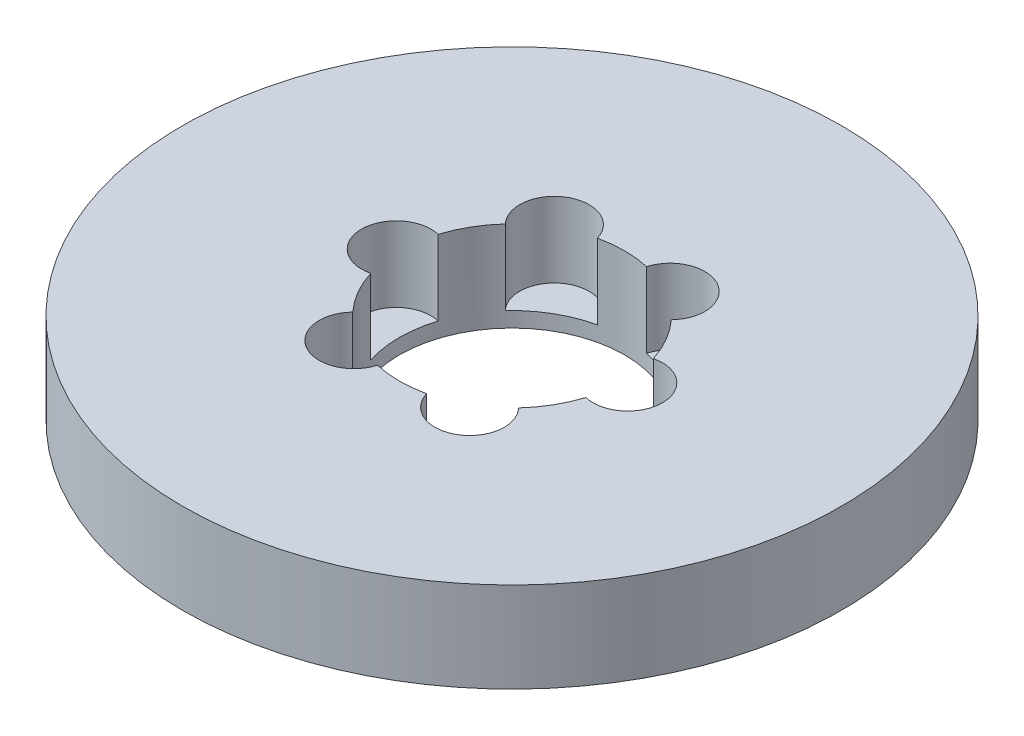
ISO-10303-21;
HEADER;
FILE_DESCRIPTION(('STEP AP214'),'2;1');
FILE_NAME('part.step','',(''),(''),'','','');
FILE_SCHEMA(('AUTOMOTIVE_DESIGN { 1 0 10303 214 1 1 1 1 }'));
ENDSEC;
DATA;
#1=APPLICATION_CONTEXT('core data for automotive mechanical design processes');
#2=APPLICATION_PROTOCOL_DEFINITION('international standard','automotive_design',2000,#1);
#3=PRODUCT_CONTEXT('',#1,'mechanical');
#4=PRODUCT('Part','Part','',(#3));
#5=PRODUCT_RELATED_PRODUCT_CATEGORY('part','',(#4));
#6=PRODUCT_DEFINITION_FORMATION('','',#4);
#7=PRODUCT_DEFINITION_CONTEXT('part definition',#1,'design');
#8=PRODUCT_DEFINITION('design','',#6,#7);
#9=PRODUCT_DEFINITION_SHAPE('','',#8);
#10=(LENGTH_UNIT() NAMED_UNIT(*) SI_UNIT(.MILLI.,.METRE.));
#11=(NAMED_UNIT(*) PLANE_ANGLE_UNIT() SI_UNIT($,.RADIAN.));
#12=(NAMED_UNIT(*) SI_UNIT($,.STERADIAN.) SOLID_ANGLE_UNIT());
#13=UNCERTAINTY_MEASURE_WITH_UNIT(LENGTH_MEASURE(1.E-05),#10,'distance_accuracy_value','');
#14=(GEOMETRIC_REPRESENTATION_CONTEXT(3) GLOBAL_UNCERTAINTY_ASSIGNED_CONTEXT((#13)) GLOBAL_UNIT_ASSIGNED_CONTEXT((#10,
#11,#12)) REPRESENTATION_CONTEXT('',''));
#15=CARTESIAN_POINT('',(0.,0.,0.));
#16=DIRECTION('',(0.,0.,1.));
#17=DIRECTION('',(1.,0.,0.));
#18=AXIS2_PLACEMENT_3D('',#15,#16,#17);
#19=CARTESIAN_POINT('',(0.,26.,0.));
#20=DIRECTION('',(0.,-1.,0.));
#21=DIRECTION('',(0.,0.,-1.));
#22=AXIS2_PLACEMENT_3D('',#19,#20,#21);
#23=CYLINDRICAL_SURFACE('',#22,95.);
#24=CARTESIAN_POINT('',(0.,26.,0.));
#25=DIRECTION('',(0.,1.,0.));
#26=DIRECTION('',(0.,0.,1.));
#27=AXIS2_PLACEMENT_3D('',#24,#25,#26);
#28=CIRCLE('',#27,95.);
#29=CARTESIAN_POINT('',(0.,26.,-95.));
#30=VERTEX_POINT('',#29);
#31=EDGE_CURVE('E171',#30,#30,#28,.T.);
#32=CARTESIAN_POINT('',(0.,0.,0.));
#33=DIRECTION('',(0.,1.,0.));
#34=DIRECTION('',(0.,0.,1.));
#35=AXIS2_PLACEMENT_3D('',#32,#33,#34);
#36=CIRCLE('',#35,95.);
#37=CARTESIAN_POINT('',(0.,0.,-95.));
#38=VERTEX_POINT('',#37);
#39=EDGE_CURVE('E157',#38,#38,#36,.T.);
#40=CARTESIAN_POINT('',(0.,26.,-95.));
#41=CARTESIAN_POINT('',(0.,25.7291666666667,-95.));
#42=CARTESIAN_POINT('',(0.,25.4583333333333,-95.));
#43=CARTESIAN_POINT('',(0.,24.9166666666667,-95.));
#44=CARTESIAN_POINT('',(0.,24.6458333333333,-95.));
#45=CARTESIAN_POINT('',(0.,24.1041666666667,-95.));
#46=CARTESIAN_POINT('',(0.,23.8333333333333,-95.));
#47=CARTESIAN_POINT('',(0.,23.2916666666667,-95.));
#48=CARTESIAN_POINT('',(0.,23.0208333333333,-95.));
#49=CARTESIAN_POINT('',(0.,22.4791666666667,-95.));
#50=CARTESIAN_POINT('',(0.,22.2083333333333,-95.));
#51=CARTESIAN_POINT('',(0.,21.6666666666667,-95.));
#52=CARTESIAN_POINT('',(0.,21.3958333333333,-95.));
#53=CARTESIAN_POINT('',(0.,20.8541666666667,-95.));
#54=CARTESIAN_POINT('',(0.,20.5833333333333,-95.));
#55=CARTESIAN_POINT('',(0.,20.0416666666667,-95.));
#56=CARTESIAN_POINT('',(0.,19.7708333333333,-95.));
#57=CARTESIAN_POINT('',(0.,19.2291666666667,-95.));
#58=CARTESIAN_POINT('',(0.,18.9583333333333,-95.));
#59=CARTESIAN_POINT('',(0.,18.4166666666667,-95.));
#60=CARTESIAN_POINT('',(0.,18.1458333333333,-95.));
#61=CARTESIAN_POINT('',(0.,17.6041666666667,-95.));
#62=CARTESIAN_POINT('',(0.,17.3333333333333,-95.));
#63=CARTESIAN_POINT('',(0.,16.7916666666667,-95.));
#64=CARTESIAN_POINT('',(0.,16.5208333333333,-95.));
#65=CARTESIAN_POINT('',(0.,15.9791666666667,-95.));
#66=CARTESIAN_POINT('',(0.,15.7083333333333,-95.));
#67=CARTESIAN_POINT('',(0.,15.1666666666667,-95.));
#68=CARTESIAN_POINT('',(0.,14.8958333333333,-95.));
#69=CARTESIAN_POINT('',(0.,14.3541666666667,-95.));
#70=CARTESIAN_POINT('',(0.,14.0833333333333,-95.));
#71=CARTESIAN_POINT('',(0.,13.5416666666667,-95.));
#72=CARTESIAN_POINT('',(0.,13.2708333333333,-95.));
#73=CARTESIAN_POINT('',(0.,12.7291666666667,-95.));
#74=CARTESIAN_POINT('',(0.,12.4583333333333,-95.));
#75=CARTESIAN_POINT('',(0.,11.9166666666667,-95.));
#76=CARTESIAN_POINT('',(0.,11.6458333333333,-95.));
#77=CARTESIAN_POINT('',(0.,11.1041666666667,-95.));
#78=CARTESIAN_POINT('',(0.,10.8333333333333,-95.));
#79=CARTESIAN_POINT('',(0.,10.2916666666667,-95.));
#80=CARTESIAN_POINT('',(0.,10.0208333333333,-95.));
#81=CARTESIAN_POINT('',(0.,9.47916666666667,-95.));
#82=CARTESIAN_POINT('',(0.,9.20833333333333,-95.));
#83=CARTESIAN_POINT('',(0.,8.66666666666667,-95.));
#84=CARTESIAN_POINT('',(0.,8.39583333333333,-95.));
#85=CARTESIAN_POINT('',(0.,7.85416666666667,-95.));
#86=CARTESIAN_POINT('',(0.,7.58333333333333,-95.));
#87=CARTESIAN_POINT('',(0.,7.04166666666667,-95.));
#88=CARTESIAN_POINT('',(0.,6.77083333333333,-95.));
#89=CARTESIAN_POINT('',(0.,6.22916666666667,-95.));
#90=CARTESIAN_POINT('',(0.,5.95833333333333,-95.));
#91=CARTESIAN_POINT('',(0.,5.41666666666667,-95.));
#92=CARTESIAN_POINT('',(0.,5.14583333333333,-95.));
#93=CARTESIAN_POINT('',(0.,4.60416666666667,-95.));
#94=CARTESIAN_POINT('',(0.,4.33333333333333,-95.));
#95=CARTESIAN_POINT('',(0.,3.79166666666667,-95.));
#96=CARTESIAN_POINT('',(0.,3.52083333333333,-95.));
#97=CARTESIAN_POINT('',(0.,2.97916666666667,-95.));
#98=CARTESIAN_POINT('',(0.,2.70833333333333,-95.));
#99=CARTESIAN_POINT('',(0.,2.16666666666667,-95.));
#100=CARTESIAN_POINT('',(0.,1.89583333333333,-95.));
#101=CARTESIAN_POINT('',(0.,1.35416666666667,-95.));
#102=CARTESIAN_POINT('',(0.,1.08333333333333,-95.));
#103=CARTESIAN_POINT('',(0.,0.541666666666667,-95.));
#104=CARTESIAN_POINT('',(0.,0.270833333333334,-95.));
#105=CARTESIAN_POINT('',(0.,0.,-95.));
#106=B_SPLINE_CURVE_WITH_KNOTS('',3,(#40,#41,#42,#43,#44,#45,#46,#47,#48,#49,#50,#51,#52,#53,
#54,#55,#56,#57,#58,#59,#60,#61,#62,#63,#64,#65,#66,#67,#68,#69,#70,#71,#72,#73,#74,#75,#76,#77,
#78,#79,#80,#81,#82,#83,#84,#85,#86,#87,#88,#89,#90,#91,#92,#93,#94,#95,#96,#97,#98,#99,#100,
#101,#102,#103,#104,#105),.UNSPECIFIED.,.F.,.F.,(4,2,2,2,2,2,2,2,2,2,2,2,2,2,2,2,2,2,2,2,2,2,2,
2,2,2,2,2,2,2,2,2,4),(0.,0.812500000000001,1.625,2.4375,3.25,4.0625,4.875,5.6875,6.5,7.3125,
8.125,8.9375,9.75,10.5625,11.375,12.1875,13.,13.8125,14.625,15.4375,16.25,17.0625,17.875,
18.6875,19.5,20.3125,21.125,21.9375,22.75,23.5625,24.375,25.1875,26.),.UNSPECIFIED.);
#107=EDGE_CURVE('BSEAM39',#30,#38,#106,.T.);
#108=ORIENTED_EDGE('',*,*,#31,.F.);
#109=ORIENTED_EDGE('',*,*,#39,.T.);
#110=ORIENTED_EDGE('',*,*,#107,.T.);
#111=ORIENTED_EDGE('',*,*,#107,.F.);
#112=EDGE_LOOP('',(#108,#110,#109,#111));
#113=FACE_BOUND('',#112,.T.);
#114=ADVANCED_FACE('F39',(#113),#23,.T.);
#115=CARTESIAN_POINT('',(0.,26.,0.));
#116=DIRECTION('',(0.,1.,0.));
#117=DIRECTION('',(0.,0.,1.));
#118=AXIS2_PLACEMENT_3D('',#115,#116,#117);
#119=PLANE('',#118);
#120=CARTESIAN_POINT('',(-16.6858090005491,26.,-28.9006689543404));
#121=DIRECTION('',(0.,1.,0.));
#122=DIRECTION('',(-0.866025403784433,0.,0.50000000000001));
#123=AXIS2_PLACEMENT_3D('',#120,#121,#122);
#124=CIRCLE('',#123,10.);
#125=CARTESIAN_POINT('',(-7.09061110925505,26.,-31.7170811093535));
#126=VERTEX_POINT('',#125);
#127=CARTESIAN_POINT('',(-23.9224924199647,26.,-21.9991899036472));
#128=VERTEX_POINT('',#127);
#129=EDGE_CURVE('E214',#126,#128,#124,.T.);
#130=ORIENTED_EDGE('',*,*,#129,.F.);
#131=CARTESIAN_POINT('',(0.,26.,0.));
#132=DIRECTION('',(0.,1.,0.));
#133=DIRECTION('',(0.,0.,1.));
#134=AXIS2_PLACEMENT_3D('',#131,#132,#133);
#135=CIRCLE('',#134,32.5);
#136=CARTESIAN_POINT('',(7.09061110925439,26.,-31.7170811093537));
#137=VERTEX_POINT('',#136);
#138=EDGE_CURVE('E272',#137,#126,#135,.T.);
#139=ORIENTED_EDGE('',*,*,#138,.F.);
#140=CARTESIAN_POINT('',(16.6858090005485,26.,-28.9006689543407));
#141=DIRECTION('',(0.,1.,0.));
#142=DIRECTION('',(-0.866025403784443,0.,-0.499999999999992));
#143=AXIS2_PLACEMENT_3D('',#140,#141,#142);
#144=CIRCLE('',#143,10.);
#145=CARTESIAN_POINT('',(23.9224924199642,26.,-21.9991899036477));
#146=VERTEX_POINT('',#145);
#147=EDGE_CURVE('E285',#146,#137,#144,.T.);
#148=ORIENTED_EDGE('',*,*,#147,.F.);
#149=CARTESIAN_POINT('',(31.0131035292191,26.,-9.71789120570608));
#150=VERTEX_POINT('',#149);
#151=EDGE_CURVE('E165',#150,#146,#135,.T.);
#152=ORIENTED_EDGE('',*,*,#151,.F.);
#153=CARTESIAN_POINT('',(33.3716180010976,26.,0.));
#154=DIRECTION('',(0.,1.,0.));
#155=DIRECTION('',(0.,0.,-1.));
#156=AXIS2_PLACEMENT_3D('',#153,#154,#155);
#157=CIRCLE('',#156,10.);
#158=CARTESIAN_POINT('',(31.0131035292191,26.,9.71789120570608));
#159=VERTEX_POINT('',#158);
#160=EDGE_CURVE('E281',#159,#150,#157,.T.);
#161=ORIENTED_EDGE('',*,*,#160,.F.);
#162=CARTESIAN_POINT('',(23.9224924199645,26.,21.9991899036474));
#163=VERTEX_POINT('',#162);
#164=EDGE_CURVE('E160',#163,#159,#135,.T.);
#165=ORIENTED_EDGE('',*,*,#164,.F.);
#166=CARTESIAN_POINT('',(16.6858090005489,26.,28.9006689543405));
#167=DIRECTION('',(0.,1.,0.));
#168=DIRECTION('',(0.866025403784436,0.,-0.500000000000004));
#169=AXIS2_PLACEMENT_3D('',#166,#167,#168);
#170=CIRCLE('',#169,10.);
#171=CARTESIAN_POINT('',(7.09061110925483,26.,31.7170811093536));
#172=VERTEX_POINT('',#171);
#173=EDGE_CURVE('E154',#172,#163,#170,.T.);
#174=ORIENTED_EDGE('',*,*,#173,.F.);
#175=CARTESIAN_POINT('',(-7.09061110925461,26.,31.7170811093536));
#176=VERTEX_POINT('',#175);
#177=EDGE_CURVE('E150',#176,#172,#135,.T.);
#178=ORIENTED_EDGE('',*,*,#177,.F.);
#179=CARTESIAN_POINT('',(-16.6858090005487,26.,28.9006689543406));
#180=DIRECTION('',(0.,1.,0.));
#181=DIRECTION('',(0.86602540378444,0.,0.499999999999998));
#182=AXIS2_PLACEMENT_3D('',#179,#180,#181);
#183=CIRCLE('',#182,10.);
#184=CARTESIAN_POINT('',(-23.9224924199643,26.,21.9991899036476));
#185=VERTEX_POINT('',#184);
#186=EDGE_CURVE('E127',#185,#176,#183,.T.);
#187=ORIENTED_EDGE('',*,*,#186,.F.);
#188=CARTESIAN_POINT('',(-31.0131035292191,26.,9.71789120570608));
#189=VERTEX_POINT('',#188);
#190=EDGE_CURVE('E156',#189,#185,#135,.T.);
#191=ORIENTED_EDGE('',*,*,#190,.F.);
#192=CARTESIAN_POINT('',(-33.3716180010976,26.,0.));
#193=DIRECTION('',(0.,1.,0.));
#194=DIRECTION('',(0.,0.,1.));
#195=AXIS2_PLACEMENT_3D('',#192,#193,#194);
#196=CIRCLE('',#195,10.);
#197=CARTESIAN_POINT('',(-31.0131035292191,26.,-9.71789120570608));
#198=VERTEX_POINT('',#197);
#199=EDGE_CURVE('E164',#198,#189,#196,.T.);
#200=ORIENTED_EDGE('',*,*,#199,.F.);
#201=EDGE_CURVE('E159',#128,#198,#135,.T.);
#202=ORIENTED_EDGE('',*,*,#201,.F.);
#203=EDGE_LOOP('',(#130,#139,#148,#152,#161,#165,#174,#178,#187,#191,#200,#202));
#204=FACE_BOUND('',#203,.T.);
#205=ORIENTED_EDGE('',*,*,#31,.T.);
#206=EDGE_LOOP('',(#205));
#207=FACE_BOUND('',#206,.T.);
#208=ADVANCED_FACE('F155',(#204,#207),#119,.T.);
#209=CARTESIAN_POINT('',(0.,0.,0.));
#210=DIRECTION('',(0.,1.,0.));
#211=DIRECTION('',(0.,0.,1.));
#212=AXIS2_PLACEMENT_3D('',#209,#210,#211);
#213=PLANE('',#212);
#214=CARTESIAN_POINT('',(0.,0.,0.));
#215=DIRECTION('',(0.,1.,0.));
#216=DIRECTION('',(0.,0.,1.));
#217=AXIS2_PLACEMENT_3D('',#214,#215,#216);
#218=CIRCLE('',#217,32.5);
#219=CARTESIAN_POINT('',(0.,0.,32.5));
#220=VERTEX_POINT('',#219);
#221=EDGE_CURVE('E170',#220,#220,#218,.T.);
#222=ORIENTED_EDGE('',*,*,#221,.T.);
#223=EDGE_LOOP('',(#222));
#224=FACE_BOUND('',#223,.T.);
#225=ORIENTED_EDGE('',*,*,#39,.F.);
#226=EDGE_LOOP('',(#225));
#227=FACE_BOUND('',#226,.T.);
#228=ADVANCED_FACE('F232',(#224,#227),#213,.F.);
#229=CARTESIAN_POINT('',(0.,26.,0.));
#230=DIRECTION('',(0.,-1.,0.));
#231=DIRECTION('',(0.,0.,-1.));
#232=AXIS2_PLACEMENT_3D('',#229,#230,#231);
#233=CYLINDRICAL_SURFACE('',#232,32.5);
#234=DIRECTION('',(0.,1.,0.));
#235=VECTOR('',#234,1.);
#236=CARTESIAN_POINT('',(-7.09061110925505,15.1814636541219,-31.7170811093535));
#237=LINE('',#236,#235);
#238=CARTESIAN_POINT('',(-7.09061110925505,4.36292730824374,-31.7170811093535));
#239=VERTEX_POINT('',#238);
#240=EDGE_CURVE('E11',#239,#126,#237,.T.);
#241=ORIENTED_EDGE('',*,*,#240,.F.);
#242=CARTESIAN_POINT('',(0.,4.36292730824374,0.));
#243=DIRECTION('',(0.,1.,0.));
#244=DIRECTION('',(0.,0.,1.));
#245=AXIS2_PLACEMENT_3D('',#242,#243,#244);
#246=CIRCLE('',#245,32.5);
#247=CARTESIAN_POINT('',(-23.9224924199647,4.36292730824374,-21.9991899036472));
#248=VERTEX_POINT('',#247);
#249=EDGE_CURVE('E209',#239,#248,#246,.T.);
#250=ORIENTED_EDGE('',*,*,#249,.T.);
#251=DIRECTION('',(0.,1.,0.));
#252=VECTOR('',#251,1.);
#253=CARTESIAN_POINT('',(-23.9224924199647,15.1814636541219,-21.9991899036472));
#254=LINE('',#253,#252);
#255=EDGE_CURVE('E46',#128,#248,#254,.F.);
#256=ORIENTED_EDGE('',*,*,#255,.F.);
#257=ORIENTED_EDGE('',*,*,#201,.T.);
#258=DIRECTION('',(0.,1.,0.));
#259=VECTOR('',#258,1.);
#260=CARTESIAN_POINT('',(-31.0131035292191,15.1814636541219,-9.71789120570608));
#261=LINE('',#260,#259);
#262=CARTESIAN_POINT('',(-31.0131035292191,4.36292730824374,-9.71789120570608));
#263=VERTEX_POINT('',#262);
#264=EDGE_CURVE('E185',#263,#198,#261,.T.);
#265=ORIENTED_EDGE('',*,*,#264,.F.);
#266=CARTESIAN_POINT('',(0.,4.36292730824374,0.));
#267=DIRECTION('',(0.,1.,0.));
#268=DIRECTION('',(0.,0.,1.));
#269=AXIS2_PLACEMENT_3D('',#266,#267,#268);
#270=CIRCLE('',#269,32.5);
#271=CARTESIAN_POINT('',(-31.0131035292191,4.36292730824374,9.71789120570608));
#272=VERTEX_POINT('',#271);
#273=EDGE_CURVE('E173',#263,#272,#270,.T.);
#274=ORIENTED_EDGE('',*,*,#273,.T.);
#275=DIRECTION('',(0.,1.,0.));
#276=VECTOR('',#275,1.);
#277=CARTESIAN_POINT('',(-31.0131035292191,15.1814636541219,9.71789120570608));
#278=LINE('',#277,#276);
#279=EDGE_CURVE('E178',#189,#272,#278,.F.);
#280=ORIENTED_EDGE('',*,*,#279,.F.);
#281=ORIENTED_EDGE('',*,*,#190,.T.);
#282=DIRECTION('',(0.,1.,0.));
#283=VECTOR('',#282,1.);
#284=CARTESIAN_POINT('',(-23.9224924199643,15.1814636541219,21.9991899036476));
#285=LINE('',#284,#283);
#286=CARTESIAN_POINT('',(-23.9224924199643,4.36292730824374,21.9991899036476));
#287=VERTEX_POINT('',#286);
#288=EDGE_CURVE('E132',#287,#185,#285,.T.);
#289=ORIENTED_EDGE('',*,*,#288,.F.);
#290=CARTESIAN_POINT('',(0.,4.36292730824374,0.));
#291=DIRECTION('',(0.,1.,0.));
#292=DIRECTION('',(0.,0.,1.));
#293=AXIS2_PLACEMENT_3D('',#290,#291,#292);
#294=CIRCLE('',#293,32.5);
#295=CARTESIAN_POINT('',(-7.09061110925461,4.36292730824374,31.7170811093536));
#296=VERTEX_POINT('',#295);
#297=EDGE_CURVE('E146',#287,#296,#294,.T.);
#298=ORIENTED_EDGE('',*,*,#297,.T.);
#299=DIRECTION('',(0.,1.,0.));
#300=VECTOR('',#299,1.);
#301=CARTESIAN_POINT('',(-7.09061110925461,15.1814636541219,31.7170811093536));
#302=LINE('',#301,#300);
#303=EDGE_CURVE('E128',#176,#296,#302,.F.);
#304=ORIENTED_EDGE('',*,*,#303,.F.);
#305=ORIENTED_EDGE('',*,*,#177,.T.);
#306=DIRECTION('',(0.,1.,0.));
#307=VECTOR('',#306,1.);
#308=CARTESIAN_POINT('',(7.09061110925483,15.1814636541219,31.7170811093536));
#309=LINE('',#308,#307);
#310=CARTESIAN_POINT('',(7.09061110925483,4.36292730824374,31.7170811093536));
#311=VERTEX_POINT('',#310);
#312=EDGE_CURVE('E192',#311,#172,#309,.T.);
#313=ORIENTED_EDGE('',*,*,#312,.F.);
#314=CARTESIAN_POINT('',(0.,4.36292730824374,0.));
#315=DIRECTION('',(0.,1.,0.));
#316=DIRECTION('',(0.,0.,1.));
#317=AXIS2_PLACEMENT_3D('',#314,#315,#316);
#318=CIRCLE('',#317,32.5);
#319=CARTESIAN_POINT('',(23.9224924199645,4.36292730824374,21.9991899036474));
#320=VERTEX_POINT('',#319);
#321=EDGE_CURVE('E190',#311,#320,#318,.T.);
#322=ORIENTED_EDGE('',*,*,#321,.T.);
#323=DIRECTION('',(0.,1.,0.));
#324=VECTOR('',#323,1.);
#325=CARTESIAN_POINT('',(23.9224924199645,15.1814636541219,21.9991899036474));
#326=LINE('',#325,#324);
#327=EDGE_CURVE('E189',#163,#320,#326,.F.);
#328=ORIENTED_EDGE('',*,*,#327,.F.);
#329=ORIENTED_EDGE('',*,*,#164,.T.);
#330=DIRECTION('',(0.,1.,0.));
#331=VECTOR('',#330,1.);
#332=CARTESIAN_POINT('',(31.0131035292191,15.1814636541219,9.71789120570608));
#333=LINE('',#332,#331);
#334=CARTESIAN_POINT('',(31.0131035292191,4.36292730824374,9.71789120570608));
#335=VERTEX_POINT('',#334);
#336=EDGE_CURVE('E203',#335,#159,#333,.T.);
#337=ORIENTED_EDGE('',*,*,#336,.F.);
#338=CARTESIAN_POINT('',(0.,4.36292730824374,0.));
#339=DIRECTION('',(0.,1.,0.));
#340=DIRECTION('',(0.,0.,1.));
#341=AXIS2_PLACEMENT_3D('',#338,#339,#340);
#342=CIRCLE('',#341,32.5);
#343=CARTESIAN_POINT('',(31.0131035292191,4.36292730824374,-9.71789120570608));
#344=VERTEX_POINT('',#343);
#345=EDGE_CURVE('E194',#335,#344,#342,.T.);
#346=ORIENTED_EDGE('',*,*,#345,.T.);
#347=DIRECTION('',(0.,1.,0.));
#348=VECTOR('',#347,1.);
#349=CARTESIAN_POINT('',(31.0131035292191,15.1814636541219,-9.71789120570608));
#350=LINE('',#349,#348);
#351=EDGE_CURVE('E196',#150,#344,#350,.F.);
#352=ORIENTED_EDGE('',*,*,#351,.F.);
#353=ORIENTED_EDGE('',*,*,#151,.T.);
#354=DIRECTION('',(0.,1.,0.));
#355=VECTOR('',#354,1.);
#356=CARTESIAN_POINT('',(23.9224924199642,15.1814636541219,-21.9991899036477));
#357=LINE('',#356,#355);
#358=CARTESIAN_POINT('',(23.9224924199642,4.36292730824374,-21.9991899036477));
#359=VERTEX_POINT('',#358);
#360=EDGE_CURVE('E208',#359,#146,#357,.T.);
#361=ORIENTED_EDGE('',*,*,#360,.F.);
#362=CARTESIAN_POINT('',(0.,4.36292730824374,0.));
#363=DIRECTION('',(0.,1.,0.));
#364=DIRECTION('',(0.,0.,1.));
#365=AXIS2_PLACEMENT_3D('',#362,#363,#364);
#366=CIRCLE('',#365,32.5);
#367=CARTESIAN_POINT('',(7.09061110925439,4.36292730824374,-31.7170811093537));
#368=VERTEX_POINT('',#367);
#369=EDGE_CURVE('E201',#359,#368,#366,.T.);
#370=ORIENTED_EDGE('',*,*,#369,.T.);
#371=DIRECTION('',(0.,1.,0.));
#372=VECTOR('',#371,1.);
#373=CARTESIAN_POINT('',(7.09061110925438,15.1814636541219,-31.7170811093537));
#374=LINE('',#373,#372);
#375=EDGE_CURVE('E206',#137,#368,#374,.F.);
#376=ORIENTED_EDGE('',*,*,#375,.F.);
#377=ORIENTED_EDGE('',*,*,#138,.T.);
#378=EDGE_LOOP('',(#241,#250,#256,#257,#265,#274,#280,#281,#289,#298,#304,#305,#313,#322,#328,
#329,#337,#346,#352,#353,#361,#370,#376,#377));
#379=FACE_BOUND('',#378,.T.);
#380=ORIENTED_EDGE('',*,*,#221,.F.);
#381=EDGE_LOOP('',(#380));
#382=FACE_BOUND('',#381,.T.);
#383=ADVANCED_FACE('F145',(#379,#382),#233,.F.);
#384=CARTESIAN_POINT('',(-33.3716180010976,4.36292730824374,0.));
#385=DIRECTION('',(0.,1.,0.));
#386=DIRECTION('',(0.,0.,1.));
#387=AXIS2_PLACEMENT_3D('',#384,#385,#386);
#388=CYLINDRICAL_SURFACE('',#387,10.);
#389=ORIENTED_EDGE('',*,*,#264,.T.);
#390=ORIENTED_EDGE('',*,*,#199,.T.);
#391=ORIENTED_EDGE('',*,*,#279,.T.);
#392=CARTESIAN_POINT('',(-33.3716180010976,4.36292730824374,0.));
#393=DIRECTION('',(0.,1.,0.));
#394=DIRECTION('',(0.,0.,1.));
#395=AXIS2_PLACEMENT_3D('',#392,#393,#394);
#396=CIRCLE('',#395,10.);
#397=EDGE_CURVE('E168',#263,#272,#396,.T.);
#398=ORIENTED_EDGE('',*,*,#397,.F.);
#399=EDGE_LOOP('',(#389,#390,#391,#398));
#400=FACE_BOUND('',#399,.T.);
#401=ADVANCED_FACE('F243',(#400),#388,.F.);
#402=CARTESIAN_POINT('',(-33.3716180010976,4.36292730824374,0.));
#403=DIRECTION('',(0.,1.,0.));
#404=DIRECTION('',(0.,0.,1.));
#405=AXIS2_PLACEMENT_3D('',#402,#403,#404);
#406=PLANE('',#405);
#407=ORIENTED_EDGE('',*,*,#397,.T.);
#408=ORIENTED_EDGE('',*,*,#273,.F.);
#409=EDGE_LOOP('',(#407,#408));
#410=FACE_BOUND('',#409,.T.);
#411=ADVANCED_FACE('F247',(#410),#406,.T.);
#412=CARTESIAN_POINT('',(-16.6858090005487,4.36292730824374,28.9006689543406));
#413=DIRECTION('',(0.,1.,0.));
#414=DIRECTION('',(0.,0.,1.));
#415=AXIS2_PLACEMENT_3D('',#412,#413,#414);
#416=CYLINDRICAL_SURFACE('',#415,10.);
#417=ORIENTED_EDGE('',*,*,#288,.T.);
#418=ORIENTED_EDGE('',*,*,#186,.T.);
#419=ORIENTED_EDGE('',*,*,#303,.T.);
#420=CARTESIAN_POINT('',(-16.6858090005487,4.36292730824374,28.9006689543406));
#421=DIRECTION('',(0.,1.,0.));
#422=DIRECTION('',(0.86602540378444,0.,0.499999999999998));
#423=AXIS2_PLACEMENT_3D('',#420,#421,#422);
#424=CIRCLE('',#423,10.);
#425=EDGE_CURVE('E137',#287,#296,#424,.T.);
#426=ORIENTED_EDGE('',*,*,#425,.F.);
#427=EDGE_LOOP('',(#417,#418,#419,#426));
#428=FACE_BOUND('',#427,.T.);
#429=ADVANCED_FACE('F126',(#428),#416,.F.);
#430=CARTESIAN_POINT('',(-16.6858090005487,4.36292730824374,28.9006689543406));
#431=DIRECTION('',(0.,1.,0.));
#432=DIRECTION('',(0.86602540378444,0.,0.499999999999998));
#433=AXIS2_PLACEMENT_3D('',#430,#431,#432);
#434=PLANE('',#433);
#435=ORIENTED_EDGE('',*,*,#425,.T.);
#436=ORIENTED_EDGE('',*,*,#297,.F.);
#437=EDGE_LOOP('',(#435,#436));
#438=FACE_BOUND('',#437,.T.);
#439=ADVANCED_FACE('F254',(#438),#434,.T.);
#440=CARTESIAN_POINT('',(16.6858090005489,4.36292730824374,28.9006689543405));
#441=DIRECTION('',(0.,1.,0.));
#442=DIRECTION('',(0.,0.,1.));
#443=AXIS2_PLACEMENT_3D('',#440,#441,#442);
#444=CYLINDRICAL_SURFACE('',#443,10.);
#445=ORIENTED_EDGE('',*,*,#312,.T.);
#446=ORIENTED_EDGE('',*,*,#173,.T.);
#447=ORIENTED_EDGE('',*,*,#327,.T.);
#448=CARTESIAN_POINT('',(16.6858090005489,4.36292730824374,28.9006689543405));
#449=DIRECTION('',(0.,1.,0.));
#450=DIRECTION('',(0.866025403784436,0.,-0.500000000000004));
#451=AXIS2_PLACEMENT_3D('',#448,#449,#450);
#452=CIRCLE('',#451,10.);
#453=EDGE_CURVE('E138',#311,#320,#452,.T.);
#454=ORIENTED_EDGE('',*,*,#453,.F.);
#455=EDGE_LOOP('',(#445,#446,#447,#454));
#456=FACE_BOUND('',#455,.T.);
#457=ADVANCED_FACE('F260',(#456),#444,.F.);
#458=CARTESIAN_POINT('',(16.6858090005489,4.36292730824374,28.9006689543405));
#459=DIRECTION('',(0.,1.,0.));
#460=DIRECTION('',(0.866025403784436,0.,-0.500000000000004));
#461=AXIS2_PLACEMENT_3D('',#458,#459,#460);
#462=PLANE('',#461);
#463=ORIENTED_EDGE('',*,*,#453,.T.);
#464=ORIENTED_EDGE('',*,*,#321,.F.);
#465=EDGE_LOOP('',(#463,#464));
#466=FACE_BOUND('',#465,.T.);
#467=ADVANCED_FACE('F265',(#466),#462,.T.);
#468=CARTESIAN_POINT('',(33.3716180010976,4.36292730824374,0.));
#469=DIRECTION('',(0.,1.,0.));
#470=DIRECTION('',(0.,0.,1.));
#471=AXIS2_PLACEMENT_3D('',#468,#469,#470);
#472=CYLINDRICAL_SURFACE('',#471,10.);
#473=ORIENTED_EDGE('',*,*,#336,.T.);
#474=ORIENTED_EDGE('',*,*,#160,.T.);
#475=ORIENTED_EDGE('',*,*,#351,.T.);
#476=CARTESIAN_POINT('',(33.3716180010976,4.36292730824374,0.));
#477=DIRECTION('',(0.,1.,0.));
#478=DIRECTION('',(0.,0.,-1.));
#479=AXIS2_PLACEMENT_3D('',#476,#477,#478);
#480=CIRCLE('',#479,10.);
#481=EDGE_CURVE('E287',#335,#344,#480,.T.);
#482=ORIENTED_EDGE('',*,*,#481,.F.);
#483=EDGE_LOOP('',(#473,#474,#475,#482));
#484=FACE_BOUND('',#483,.T.);
#485=ADVANCED_FACE('F300',(#484),#472,.F.);
#486=CARTESIAN_POINT('',(33.3716180010976,4.36292730824374,0.));
#487=DIRECTION('',(0.,1.,0.));
#488=DIRECTION('',(0.,0.,-1.));
#489=AXIS2_PLACEMENT_3D('',#486,#487,#488);
#490=PLANE('',#489);
#491=ORIENTED_EDGE('',*,*,#481,.T.);
#492=ORIENTED_EDGE('',*,*,#345,.F.);
#493=EDGE_LOOP('',(#491,#492));
#494=FACE_BOUND('',#493,.T.);
#495=ADVANCED_FACE('F298',(#494),#490,.T.);
#496=CARTESIAN_POINT('',(16.6858090005485,4.36292730824374,-28.9006689543407));
#497=DIRECTION('',(0.,1.,0.));
#498=DIRECTION('',(0.,0.,1.));
#499=AXIS2_PLACEMENT_3D('',#496,#497,#498);
#500=CYLINDRICAL_SURFACE('',#499,10.);
#501=ORIENTED_EDGE('',*,*,#360,.T.);
#502=ORIENTED_EDGE('',*,*,#147,.T.);
#503=ORIENTED_EDGE('',*,*,#375,.T.);
#504=CARTESIAN_POINT('',(16.6858090005485,4.36292730824374,-28.9006689543407));
#505=DIRECTION('',(0.,1.,0.));
#506=DIRECTION('',(-0.866025403784443,0.,-0.499999999999992));
#507=AXIS2_PLACEMENT_3D('',#504,#505,#506);
#508=CIRCLE('',#507,10.);
#509=EDGE_CURVE('E56',#359,#368,#508,.T.);
#510=ORIENTED_EDGE('',*,*,#509,.F.);
#511=EDGE_LOOP('',(#501,#502,#503,#510));
#512=FACE_BOUND('',#511,.T.);
#513=ADVANCED_FACE('F301',(#512),#500,.F.);
#514=CARTESIAN_POINT('',(16.6858090005485,4.36292730824374,-28.9006689543407));
#515=DIRECTION('',(0.,1.,0.));
#516=DIRECTION('',(-0.866025403784443,0.,-0.499999999999992));
#517=AXIS2_PLACEMENT_3D('',#514,#515,#516);
#518=PLANE('',#517);
#519=ORIENTED_EDGE('',*,*,#509,.T.);
#520=ORIENTED_EDGE('',*,*,#369,.F.);
#521=EDGE_LOOP('',(#519,#520));
#522=FACE_BOUND('',#521,.T.);
#523=ADVANCED_FACE('F221',(#522),#518,.T.);
#524=CARTESIAN_POINT('',(-16.6858090005491,4.36292730824374,-28.9006689543404));
#525=DIRECTION('',(0.,1.,0.));
#526=DIRECTION('',(0.,0.,1.));
#527=AXIS2_PLACEMENT_3D('',#524,#525,#526);
#528=CYLINDRICAL_SURFACE('',#527,10.);
#529=ORIENTED_EDGE('',*,*,#240,.T.);
#530=ORIENTED_EDGE('',*,*,#129,.T.);
#531=ORIENTED_EDGE('',*,*,#255,.T.);
#532=CARTESIAN_POINT('',(-16.6858090005491,4.36292730824374,-28.9006689543404));
#533=DIRECTION('',(0.,1.,0.));
#534=DIRECTION('',(-0.866025403784433,0.,0.50000000000001));
#535=AXIS2_PLACEMENT_3D('',#532,#533,#534);
#536=CIRCLE('',#535,10.);
#537=EDGE_CURVE('E55',#239,#248,#536,.T.);
#538=ORIENTED_EDGE('',*,*,#537,.F.);
#539=EDGE_LOOP('',(#529,#530,#531,#538));
#540=FACE_BOUND('',#539,.T.);
#541=ADVANCED_FACE('F212',(#540),#528,.F.);
#542=CARTESIAN_POINT('',(-16.6858090005491,4.36292730824374,-28.9006689543404));
#543=DIRECTION('',(0.,1.,0.));
#544=DIRECTION('',(-0.866025403784433,0.,0.50000000000001));
#545=AXIS2_PLACEMENT_3D('',#542,#543,#544);
#546=PLANE('',#545);
#547=ORIENTED_EDGE('',*,*,#537,.T.);
#548=ORIENTED_EDGE('',*,*,#249,.F.);
#549=EDGE_LOOP('',(#547,#548));
#550=FACE_BOUND('',#549,.T.);
#551=ADVANCED_FACE('F217',(#550),#546,.T.);
#552=CLOSED_SHELL('',(#114,#208,#228,#383,#401,#411,#429,#439,#457,#467,#485,#495,#513,#523,
#541,#551));
#553=MANIFOLD_SOLID_BREP('B2',#552);
#554=ADVANCED_BREP_SHAPE_REPRESENTATION('',(#18,#553),#14);
#555=SHAPE_DEFINITION_REPRESENTATION(#9,#554);
ENDSEC;
END-ISO-10303-21;
